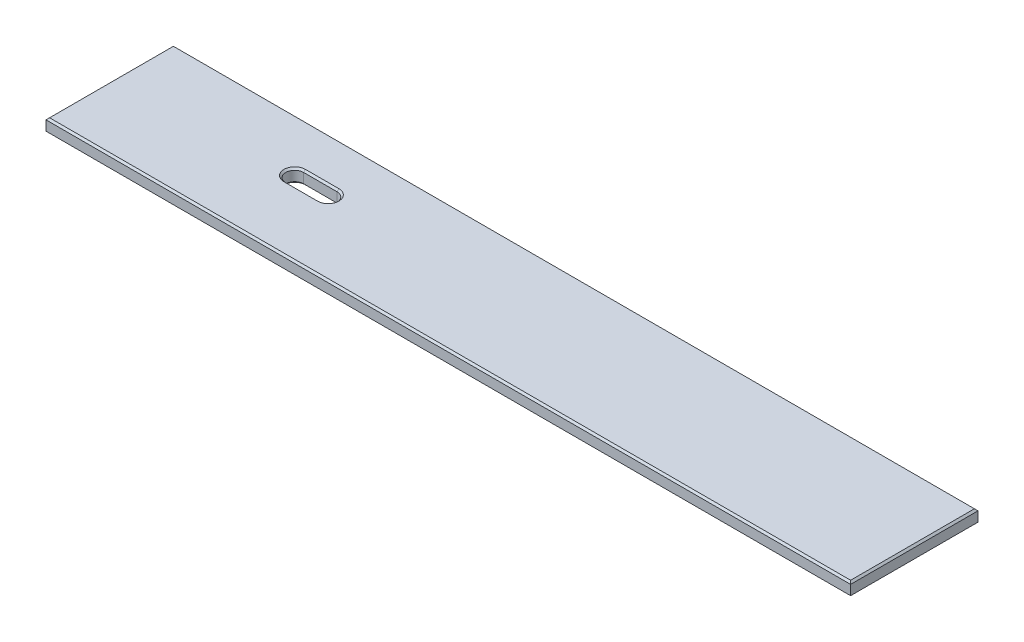
ISO-10303-21;
HEADER;
FILE_DESCRIPTION(('STEP AP214'),'2;1');
FILE_NAME('part.step','',(''),(''),'','','');
FILE_SCHEMA(('AUTOMOTIVE_DESIGN { 1 0 10303 214 1 1 1 1 }'));
ENDSEC;
DATA;
#1=APPLICATION_CONTEXT('core data for automotive mechanical design processes');
#2=APPLICATION_PROTOCOL_DEFINITION('international standard','automotive_design',2000,#1);
#3=PRODUCT_CONTEXT('',#1,'mechanical');
#4=PRODUCT('Part','Part','',(#3));
#5=PRODUCT_RELATED_PRODUCT_CATEGORY('part','',(#4));
#6=PRODUCT_DEFINITION_FORMATION('','',#4);
#7=PRODUCT_DEFINITION_CONTEXT('part definition',#1,'design');
#8=PRODUCT_DEFINITION('design','',#6,#7);
#9=PRODUCT_DEFINITION_SHAPE('','',#8);
#10=(LENGTH_UNIT() NAMED_UNIT(*) SI_UNIT(.MILLI.,.METRE.));
#11=(NAMED_UNIT(*) PLANE_ANGLE_UNIT() SI_UNIT($,.RADIAN.));
#12=(NAMED_UNIT(*) SI_UNIT($,.STERADIAN.) SOLID_ANGLE_UNIT());
#13=UNCERTAINTY_MEASURE_WITH_UNIT(LENGTH_MEASURE(1.E-05),#10,'distance_accuracy_value','');
#14=(GEOMETRIC_REPRESENTATION_CONTEXT(3) GLOBAL_UNCERTAINTY_ASSIGNED_CONTEXT((#13)) GLOBAL_UNIT_ASSIGNED_CONTEXT((#10,
#11,#12)) REPRESENTATION_CONTEXT('',''));
#15=CARTESIAN_POINT('',(0.,0.,0.));
#16=DIRECTION('',(0.,0.,1.));
#17=DIRECTION('',(1.,0.,0.));
#18=AXIS2_PLACEMENT_3D('',#15,#16,#17);
#19=CARTESIAN_POINT('',(0.,19.05,0.));
#20=DIRECTION('',(0.,-1.,0.));
#21=DIRECTION('',(0.,0.,-1.));
#22=AXIS2_PLACEMENT_3D('',#19,#20,#21);
#23=PLANE('',#22);
#24=CARTESIAN_POINT('',(247.7262,19.05,-105.55605));
#25=DIRECTION('',(0.,-1.,0.));
#26=DIRECTION('',(0.,0.,-1.));
#27=AXIS2_PLACEMENT_3D('',#24,#25,#26);
#28=CIRCLE('',#27,15.2400000000006);
#29=CARTESIAN_POINT('',(247.7262,19.05,-90.3160499999994));
#30=VERTEX_POINT('',#29);
#31=CARTESIAN_POINT('',(247.7262,19.05,-120.796050000001));
#32=VERTEX_POINT('',#31);
#33=EDGE_CURVE('E217',#30,#32,#28,.T.);
#34=ORIENTED_EDGE('',*,*,#33,.T.);
#35=DIRECTION('',(1.,0.,0.));
#36=VECTOR('',#35,1.);
#37=CARTESIAN_POINT('',(295.2877,19.05,-120.796050000001));
#38=LINE('',#37,#36);
#39=CARTESIAN_POINT('',(295.2877,19.05,-120.796050000001));
#40=VERTEX_POINT('',#39);
#41=EDGE_CURVE('E219',#32,#40,#38,.T.);
#42=ORIENTED_EDGE('',*,*,#41,.T.);
#43=CARTESIAN_POINT('',(295.2877,19.05,-105.55605));
#44=DIRECTION('',(0.,-1.,0.));
#45=DIRECTION('',(0.,0.,-1.));
#46=AXIS2_PLACEMENT_3D('',#43,#44,#45);
#47=CIRCLE('',#46,15.2400000000006);
#48=CARTESIAN_POINT('',(295.2877,19.05,-90.3160499999994));
#49=VERTEX_POINT('',#48);
#50=EDGE_CURVE('E188',#40,#49,#47,.T.);
#51=ORIENTED_EDGE('',*,*,#50,.T.);
#52=DIRECTION('',(-1.,0.,0.));
#53=VECTOR('',#52,1.);
#54=CARTESIAN_POINT('',(247.7262,19.05,-90.3160499999994));
#55=LINE('',#54,#53);
#56=EDGE_CURVE('E215',#49,#30,#55,.T.);
#57=ORIENTED_EDGE('',*,*,#56,.T.);
#58=EDGE_LOOP('',(#34,#42,#51,#57));
#59=FACE_BOUND('',#58,.T.);
#60=DIRECTION('',(0.,0.,-1.));
#61=VECTOR('',#60,1.);
#62=CARTESIAN_POINT('',(1140.46,19.05,0.));
#63=LINE('',#62,#61);
#64=CARTESIAN_POINT('',(1140.46,19.05,-2.5400000000001));
#65=VERTEX_POINT('',#64);
#66=CARTESIAN_POINT('',(1140.46,19.05,-178.435));
#67=VERTEX_POINT('',#66);
#68=EDGE_CURVE('E209',#65,#67,#63,.T.);
#69=ORIENTED_EDGE('',*,*,#68,.T.);
#70=DIRECTION('',(-1.,0.,0.));
#71=VECTOR('',#70,1.);
#72=CARTESIAN_POINT('',(0.,19.05,-178.435));
#73=LINE('',#72,#71);
#74=CARTESIAN_POINT('',(2.5400000000001,19.05,-178.435));
#75=VERTEX_POINT('',#74);
#76=EDGE_CURVE('E211',#67,#75,#73,.T.);
#77=ORIENTED_EDGE('',*,*,#76,.T.);
#78=DIRECTION('',(0.,0.,1.));
#79=VECTOR('',#78,1.);
#80=CARTESIAN_POINT('',(2.5400000000001,19.05,0.));
#81=LINE('',#80,#79);
#82=CARTESIAN_POINT('',(2.5400000000001,19.05,-2.5400000000001));
#83=VERTEX_POINT('',#82);
#84=EDGE_CURVE('E198',#75,#83,#81,.T.);
#85=ORIENTED_EDGE('',*,*,#84,.T.);
#86=DIRECTION('',(1.,0.,0.));
#87=VECTOR('',#86,1.);
#88=CARTESIAN_POINT('',(0.,19.05,-2.5400000000001));
#89=LINE('',#88,#87);
#90=EDGE_CURVE('E201',#83,#65,#89,.T.);
#91=ORIENTED_EDGE('',*,*,#90,.T.);
#92=EDGE_LOOP('',(#69,#77,#85,#91));
#93=FACE_BOUND('',#92,.T.);
#94=ADVANCED_FACE('F41',(#59,#93),#23,.F.);
#95=CARTESIAN_POINT('',(0.,0.,0.));
#96=DIRECTION('',(0.,-1.,0.));
#97=DIRECTION('',(0.,0.,-1.));
#98=AXIS2_PLACEMENT_3D('',#95,#96,#97);
#99=PLANE('',#98);
#100=DIRECTION('',(-1.,0.,0.));
#101=VECTOR('',#100,1.);
#102=CARTESIAN_POINT('',(0.,0.,-120.79605));
#103=LINE('',#102,#101);
#104=CARTESIAN_POINT('',(295.2877,0.,-120.79605));
#105=VERTEX_POINT('',#104);
#106=CARTESIAN_POINT('',(247.7262,0.,-120.79605));
#107=VERTEX_POINT('',#106);
#108=EDGE_CURVE('E261',#105,#107,#103,.T.);
#109=ORIENTED_EDGE('',*,*,#108,.T.);
#110=CARTESIAN_POINT('',(247.7262,0.,-105.55605));
#111=DIRECTION('',(0.,-1.,0.));
#112=DIRECTION('',(0.,0.,-1.));
#113=AXIS2_PLACEMENT_3D('',#110,#111,#112);
#114=CIRCLE('',#113,15.2400000000001);
#115=CARTESIAN_POINT('',(247.7262,0.,-90.3160499999999));
#116=VERTEX_POINT('',#115);
#117=EDGE_CURVE('E263',#107,#116,#114,.F.);
#118=ORIENTED_EDGE('',*,*,#117,.T.);
#119=DIRECTION('',(1.,0.,0.));
#120=VECTOR('',#119,1.);
#121=CARTESIAN_POINT('',(0.,0.,-90.3160499999999));
#122=LINE('',#121,#120);
#123=CARTESIAN_POINT('',(295.2877,0.,-90.3160499999999));
#124=VERTEX_POINT('',#123);
#125=EDGE_CURVE('E257',#116,#124,#122,.T.);
#126=ORIENTED_EDGE('',*,*,#125,.T.);
#127=CARTESIAN_POINT('',(295.2877,0.,-105.55605));
#128=DIRECTION('',(0.,-1.,0.));
#129=DIRECTION('',(0.,0.,-1.));
#130=AXIS2_PLACEMENT_3D('',#127,#128,#129);
#131=CIRCLE('',#130,15.2400000000001);
#132=EDGE_CURVE('E259',#124,#105,#131,.F.);
#133=ORIENTED_EDGE('',*,*,#132,.T.);
#134=EDGE_LOOP('',(#109,#118,#126,#133));
#135=FACE_BOUND('',#134,.T.);
#136=DIRECTION('',(0.,0.,1.));
#137=VECTOR('',#136,1.);
#138=CARTESIAN_POINT('',(1140.46,0.,0.));
#139=LINE('',#138,#137);
#140=CARTESIAN_POINT('',(1140.46,0.,-178.435));
#141=VERTEX_POINT('',#140);
#142=CARTESIAN_POINT('',(1140.46,0.,-2.53999999999999));
#143=VERTEX_POINT('',#142);
#144=EDGE_CURVE('E252',#141,#143,#139,.T.);
#145=ORIENTED_EDGE('',*,*,#144,.T.);
#146=DIRECTION('',(-1.,0.,0.));
#147=VECTOR('',#146,1.);
#148=CARTESIAN_POINT('',(0.,0.,-2.53999999999999));
#149=LINE('',#148,#147);
#150=CARTESIAN_POINT('',(2.53999999999999,0.,-2.53999999999999));
#151=VERTEX_POINT('',#150);
#152=EDGE_CURVE('E254',#143,#151,#149,.T.);
#153=ORIENTED_EDGE('',*,*,#152,.T.);
#154=DIRECTION('',(0.,0.,-1.));
#155=VECTOR('',#154,1.);
#156=CARTESIAN_POINT('',(2.53999999999999,0.,-180.975));
#157=LINE('',#156,#155);
#158=CARTESIAN_POINT('',(2.53999999999999,0.,-178.435));
#159=VERTEX_POINT('',#158);
#160=EDGE_CURVE('E232',#151,#159,#157,.T.);
#161=ORIENTED_EDGE('',*,*,#160,.T.);
#162=DIRECTION('',(1.,0.,0.));
#163=VECTOR('',#162,1.);
#164=CARTESIAN_POINT('',(1143.,0.,-178.435));
#165=LINE('',#164,#163);
#166=EDGE_CURVE('E250',#159,#141,#165,.T.);
#167=ORIENTED_EDGE('',*,*,#166,.T.);
#168=EDGE_LOOP('',(#145,#153,#161,#167));
#169=FACE_BOUND('',#168,.T.);
#170=ADVANCED_FACE('F306',(#135,#169),#99,.T.);
#171=CARTESIAN_POINT('',(0.,19.05,0.));
#172=DIRECTION('',(1.,0.,0.));
#173=DIRECTION('',(0.,0.,-1.));
#174=AXIS2_PLACEMENT_3D('',#171,#172,#173);
#175=PLANE('',#174);
#176=DIRECTION('',(0.,-1.,0.));
#177=VECTOR('',#176,1.);
#178=CARTESIAN_POINT('',(0.,19.05,-180.975));
#179=LINE('',#178,#177);
#180=CARTESIAN_POINT('',(0.,16.51,-180.975));
#181=VERTEX_POINT('',#180);
#182=CARTESIAN_POINT('',(0.,2.5400000000001,-180.975));
#183=VERTEX_POINT('',#182);
#184=EDGE_CURVE('E182',#181,#183,#179,.T.);
#185=ORIENTED_EDGE('',*,*,#184,.T.);
#186=DIRECTION('',(0.,0.,1.));
#187=VECTOR('',#186,1.);
#188=CARTESIAN_POINT('',(0.,2.5400000000001,0.));
#189=LINE('',#188,#187);
#190=CARTESIAN_POINT('',(0.,2.5400000000001,0.));
#191=VERTEX_POINT('',#190);
#192=EDGE_CURVE('E11',#183,#191,#189,.T.);
#193=ORIENTED_EDGE('',*,*,#192,.T.);
#194=DIRECTION('',(0.,-1.,0.));
#195=VECTOR('',#194,1.);
#196=CARTESIAN_POINT('',(0.,19.05,0.));
#197=LINE('',#196,#195);
#198=CARTESIAN_POINT('',(0.,16.51,0.));
#199=VERTEX_POINT('',#198);
#200=EDGE_CURVE('E199',#199,#191,#197,.T.);
#201=ORIENTED_EDGE('',*,*,#200,.F.);
#202=DIRECTION('',(0.,0.,-1.));
#203=VECTOR('',#202,1.);
#204=CARTESIAN_POINT('',(0.,16.51,0.));
#205=LINE('',#204,#203);
#206=EDGE_CURVE('E230',#199,#181,#205,.T.);
#207=ORIENTED_EDGE('',*,*,#206,.T.);
#208=EDGE_LOOP('',(#185,#193,#201,#207));
#209=FACE_BOUND('',#208,.T.);
#210=ADVANCED_FACE('F379',(#209),#175,.F.);
#211=CARTESIAN_POINT('',(0.,19.05,0.));
#212=DIRECTION('',(0.,0.,-1.));
#213=DIRECTION('',(-1.,0.,0.));
#214=AXIS2_PLACEMENT_3D('',#211,#212,#213);
#215=PLANE('',#214);
#216=ORIENTED_EDGE('',*,*,#200,.T.);
#217=DIRECTION('',(1.,0.,0.));
#218=VECTOR('',#217,1.);
#219=CARTESIAN_POINT('',(1143.,2.5400000000001,0.));
#220=LINE('',#219,#218);
#221=CARTESIAN_POINT('',(1143.,2.5400000000001,0.));
#222=VERTEX_POINT('',#221);
#223=EDGE_CURVE('E274',#191,#222,#220,.T.);
#224=ORIENTED_EDGE('',*,*,#223,.T.);
#225=DIRECTION('',(0.,-1.,0.));
#226=VECTOR('',#225,1.);
#227=CARTESIAN_POINT('',(1143.,19.05,0.));
#228=LINE('',#227,#226);
#229=CARTESIAN_POINT('',(1143.,16.51,0.));
#230=VERTEX_POINT('',#229);
#231=EDGE_CURVE('E204',#230,#222,#228,.T.);
#232=ORIENTED_EDGE('',*,*,#231,.F.);
#233=DIRECTION('',(-1.,0.,0.));
#234=VECTOR('',#233,1.);
#235=CARTESIAN_POINT('',(0.,16.51,0.));
#236=LINE('',#235,#234);
#237=EDGE_CURVE('E228',#230,#199,#236,.T.);
#238=ORIENTED_EDGE('',*,*,#237,.T.);
#239=EDGE_LOOP('',(#216,#224,#232,#238));
#240=FACE_BOUND('',#239,.T.);
#241=ADVANCED_FACE('F315',(#240),#215,.F.);
#242=CARTESIAN_POINT('',(1143.,19.05,0.));
#243=DIRECTION('',(-1.,0.,0.));
#244=DIRECTION('',(0.,0.,1.));
#245=AXIS2_PLACEMENT_3D('',#242,#243,#244);
#246=PLANE('',#245);
#247=ORIENTED_EDGE('',*,*,#231,.T.);
#248=DIRECTION('',(0.,0.,-1.));
#249=VECTOR('',#248,1.);
#250=CARTESIAN_POINT('',(1143.,2.5400000000001,-180.975));
#251=LINE('',#250,#249);
#252=CARTESIAN_POINT('',(1143.,2.5400000000001,-180.975));
#253=VERTEX_POINT('',#252);
#254=EDGE_CURVE('E66',#222,#253,#251,.T.);
#255=ORIENTED_EDGE('',*,*,#254,.T.);
#256=DIRECTION('',(0.,-1.,0.));
#257=VECTOR('',#256,1.);
#258=CARTESIAN_POINT('',(1143.,19.05,-180.975));
#259=LINE('',#258,#257);
#260=CARTESIAN_POINT('',(1143.,16.51,-180.975));
#261=VERTEX_POINT('',#260);
#262=EDGE_CURVE('E320',#261,#253,#259,.T.);
#263=ORIENTED_EDGE('',*,*,#262,.F.);
#264=DIRECTION('',(0.,0.,1.));
#265=VECTOR('',#264,1.);
#266=CARTESIAN_POINT('',(1143.,16.51,0.));
#267=LINE('',#266,#265);
#268=EDGE_CURVE('E226',#261,#230,#267,.T.);
#269=ORIENTED_EDGE('',*,*,#268,.T.);
#270=EDGE_LOOP('',(#247,#255,#263,#269));
#271=FACE_BOUND('',#270,.T.);
#272=ADVANCED_FACE('F318',(#271),#246,.F.);
#273=CARTESIAN_POINT('',(0.,19.05,-180.975));
#274=DIRECTION('',(0.,0.,1.));
#275=DIRECTION('',(1.,0.,0.));
#276=AXIS2_PLACEMENT_3D('',#273,#274,#275);
#277=PLANE('',#276);
#278=ORIENTED_EDGE('',*,*,#262,.T.);
#279=DIRECTION('',(-1.,0.,0.));
#280=VECTOR('',#279,1.);
#281=CARTESIAN_POINT('',(0.,2.5400000000001,-180.975));
#282=LINE('',#281,#280);
#283=EDGE_CURVE('E51',#253,#183,#282,.T.);
#284=ORIENTED_EDGE('',*,*,#283,.T.);
#285=ORIENTED_EDGE('',*,*,#184,.F.);
#286=DIRECTION('',(1.,0.,0.));
#287=VECTOR('',#286,1.);
#288=CARTESIAN_POINT('',(0.,16.51,-180.975));
#289=LINE('',#288,#287);
#290=EDGE_CURVE('E170',#181,#261,#289,.T.);
#291=ORIENTED_EDGE('',*,*,#290,.T.);
#292=EDGE_LOOP('',(#278,#284,#285,#291));
#293=FACE_BOUND('',#292,.T.);
#294=ADVANCED_FACE('F380',(#293),#277,.F.);
#295=CARTESIAN_POINT('',(295.2877,19.05,-105.55605));
#296=DIRECTION('',(0.,-1.,0.));
#297=DIRECTION('',(0.,0.,-1.));
#298=AXIS2_PLACEMENT_3D('',#295,#296,#297);
#299=CYLINDRICAL_SURFACE('',#298,12.7);
#300=DIRECTION('',(0.,-1.,0.));
#301=VECTOR('',#300,1.);
#302=CARTESIAN_POINT('',(295.2877,19.05,-118.25605));
#303=LINE('',#302,#301);
#304=CARTESIAN_POINT('',(295.2877,16.5099999999995,-118.25605));
#305=VERTEX_POINT('',#304);
#306=CARTESIAN_POINT('',(295.2877,2.5400000000001,-118.25605));
#307=VERTEX_POINT('',#306);
#308=EDGE_CURVE('E162',#305,#307,#303,.T.);
#309=ORIENTED_EDGE('',*,*,#308,.T.);
#310=CARTESIAN_POINT('',(295.2877,2.5400000000001,-105.55605));
#311=DIRECTION('',(0.,-1.,0.));
#312=DIRECTION('',(0.,0.,-1.));
#313=AXIS2_PLACEMENT_3D('',#310,#311,#312);
#314=CIRCLE('',#313,12.7);
#315=CARTESIAN_POINT('',(295.2877,2.5400000000001,-92.85605));
#316=VERTEX_POINT('',#315);
#317=EDGE_CURVE('E270',#307,#316,#314,.T.);
#318=ORIENTED_EDGE('',*,*,#317,.T.);
#319=DIRECTION('',(0.,-1.,0.));
#320=VECTOR('',#319,1.);
#321=CARTESIAN_POINT('',(295.2877,19.05,-92.85605));
#322=LINE('',#321,#320);
#323=CARTESIAN_POINT('',(295.2877,16.5099999999995,-92.85605));
#324=VERTEX_POINT('',#323);
#325=EDGE_CURVE('E165',#324,#316,#322,.T.);
#326=ORIENTED_EDGE('',*,*,#325,.F.);
#327=CARTESIAN_POINT('',(295.2877,16.5099999999995,-105.55605));
#328=DIRECTION('',(0.,-1.,0.));
#329=DIRECTION('',(0.,0.,-1.));
#330=AXIS2_PLACEMENT_3D('',#327,#328,#329);
#331=CIRCLE('',#330,12.7);
#332=EDGE_CURVE('E159',#324,#305,#331,.F.);
#333=ORIENTED_EDGE('',*,*,#332,.T.);
#334=EDGE_LOOP('',(#309,#318,#326,#333));
#335=FACE_BOUND('',#334,.T.);
#336=ADVANCED_FACE('F161',(#335),#299,.F.);
#337=CARTESIAN_POINT('',(247.7262,19.05,-118.25605));
#338=DIRECTION('',(0.,0.,1.));
#339=DIRECTION('',(1.,0.,0.));
#340=AXIS2_PLACEMENT_3D('',#337,#338,#339);
#341=PLANE('',#340);
#342=DIRECTION('',(0.,-1.,0.));
#343=VECTOR('',#342,1.);
#344=CARTESIAN_POINT('',(247.7262,19.05,-118.25605));
#345=LINE('',#344,#343);
#346=CARTESIAN_POINT('',(247.7262,16.5099999999995,-118.25605));
#347=VERTEX_POINT('',#346);
#348=CARTESIAN_POINT('',(247.7262,2.5400000000001,-118.25605));
#349=VERTEX_POINT('',#348);
#350=EDGE_CURVE('E183',#347,#349,#345,.T.);
#351=ORIENTED_EDGE('',*,*,#350,.T.);
#352=DIRECTION('',(1.,0.,0.));
#353=VECTOR('',#352,1.);
#354=CARTESIAN_POINT('',(247.7262,2.5400000000001,-118.25605));
#355=LINE('',#354,#353);
#356=EDGE_CURVE('E181',#349,#307,#355,.T.);
#357=ORIENTED_EDGE('',*,*,#356,.T.);
#358=ORIENTED_EDGE('',*,*,#308,.F.);
#359=DIRECTION('',(-1.,0.,0.));
#360=VECTOR('',#359,1.);
#361=CARTESIAN_POINT('',(247.7262,16.5099999999995,-118.25605));
#362=LINE('',#361,#360);
#363=EDGE_CURVE('E178',#305,#347,#362,.T.);
#364=ORIENTED_EDGE('',*,*,#363,.T.);
#365=EDGE_LOOP('',(#351,#357,#358,#364));
#366=FACE_BOUND('',#365,.T.);
#367=ADVANCED_FACE('F176',(#366),#341,.T.);
#368=CARTESIAN_POINT('',(247.7262,19.05,-105.55605));
#369=DIRECTION('',(0.,-1.,0.));
#370=DIRECTION('',(0.,0.,-1.));
#371=AXIS2_PLACEMENT_3D('',#368,#369,#370);
#372=CYLINDRICAL_SURFACE('',#371,12.7);
#373=DIRECTION('',(0.,-1.,0.));
#374=VECTOR('',#373,1.);
#375=CARTESIAN_POINT('',(247.7262,19.05,-92.85605));
#376=LINE('',#375,#374);
#377=CARTESIAN_POINT('',(247.7262,16.5099999999995,-92.85605));
#378=VERTEX_POINT('',#377);
#379=CARTESIAN_POINT('',(247.7262,2.5400000000001,-92.85605));
#380=VERTEX_POINT('',#379);
#381=EDGE_CURVE('E325',#378,#380,#376,.T.);
#382=ORIENTED_EDGE('',*,*,#381,.T.);
#383=CARTESIAN_POINT('',(247.7262,2.5400000000001,-105.55605));
#384=DIRECTION('',(0.,-1.,0.));
#385=DIRECTION('',(0.,0.,-1.));
#386=AXIS2_PLACEMENT_3D('',#383,#384,#385);
#387=CIRCLE('',#386,12.7);
#388=EDGE_CURVE('E266',#380,#349,#387,.T.);
#389=ORIENTED_EDGE('',*,*,#388,.T.);
#390=ORIENTED_EDGE('',*,*,#350,.F.);
#391=CARTESIAN_POINT('',(247.7262,16.5099999999995,-105.55605));
#392=DIRECTION('',(0.,-1.,0.));
#393=DIRECTION('',(0.,0.,-1.));
#394=AXIS2_PLACEMENT_3D('',#391,#392,#393);
#395=CIRCLE('',#394,12.7);
#396=EDGE_CURVE('E221',#347,#378,#395,.F.);
#397=ORIENTED_EDGE('',*,*,#396,.T.);
#398=EDGE_LOOP('',(#382,#389,#390,#397));
#399=FACE_BOUND('',#398,.T.);
#400=ADVANCED_FACE('F348',(#399),#372,.F.);
#401=CARTESIAN_POINT('',(247.7262,19.05,-92.85605));
#402=DIRECTION('',(0.,0.,-1.));
#403=DIRECTION('',(-1.,0.,0.));
#404=AXIS2_PLACEMENT_3D('',#401,#402,#403);
#405=PLANE('',#404);
#406=ORIENTED_EDGE('',*,*,#325,.T.);
#407=DIRECTION('',(-1.,0.,0.));
#408=VECTOR('',#407,1.);
#409=CARTESIAN_POINT('',(247.7262,2.5400000000001,-92.85605));
#410=LINE('',#409,#408);
#411=EDGE_CURVE('E272',#316,#380,#410,.T.);
#412=ORIENTED_EDGE('',*,*,#411,.T.);
#413=ORIENTED_EDGE('',*,*,#381,.F.);
#414=DIRECTION('',(1.,0.,0.));
#415=VECTOR('',#414,1.);
#416=CARTESIAN_POINT('',(295.2877,16.5099999999995,-92.85605));
#417=LINE('',#416,#415);
#418=EDGE_CURVE('E171',#378,#324,#417,.T.);
#419=ORIENTED_EDGE('',*,*,#418,.T.);
#420=EDGE_LOOP('',(#406,#412,#413,#419));
#421=FACE_BOUND('',#420,.T.);
#422=ADVANCED_FACE('F330',(#421),#405,.T.);
#423=CARTESIAN_POINT('',(247.7262,16.5099999999995,-92.85605));
#424=DIRECTION('',(0.,0.707106781186557,-0.707106781186538));
#425=DIRECTION('',(-1.,0.,0.));
#426=AXIS2_PLACEMENT_3D('',#423,#424,#425);
#427=PLANE('',#426);
#428=DIRECTION('',(0.,-0.707106781186538,-0.707106781186557));
#429=VECTOR('',#428,1.);
#430=CARTESIAN_POINT('',(247.7262,19.05,-90.3160499999994));
#431=LINE('',#430,#429);
#432=EDGE_CURVE('E192',#30,#378,#431,.T.);
#433=ORIENTED_EDGE('',*,*,#432,.F.);
#434=ORIENTED_EDGE('',*,*,#56,.F.);
#435=DIRECTION('',(0.,0.707106781186538,0.707106781186557));
#436=VECTOR('',#435,1.);
#437=CARTESIAN_POINT('',(295.2877,16.5099999999995,-92.85605));
#438=LINE('',#437,#436);
#439=EDGE_CURVE('E237',#324,#49,#438,.T.);
#440=ORIENTED_EDGE('',*,*,#439,.F.);
#441=ORIENTED_EDGE('',*,*,#418,.F.);
#442=EDGE_LOOP('',(#433,#434,#440,#441));
#443=FACE_BOUND('',#442,.T.);
#444=ADVANCED_FACE('F351',(#443),#427,.T.);
#445=CARTESIAN_POINT('',(295.2877,16.5099999999995,-105.55605));
#446=DIRECTION('',(0.,1.,0.));
#447=DIRECTION('',(0.,0.,1.));
#448=AXIS2_PLACEMENT_3D('',#445,#446,#447);
#449=CONICAL_SURFACE('',#448,12.7,0.785398163397461);
#450=ORIENTED_EDGE('',*,*,#439,.T.);
#451=ORIENTED_EDGE('',*,*,#50,.F.);
#452=DIRECTION('',(0.,0.707106781186538,-0.707106781186557));
#453=VECTOR('',#452,1.);
#454=CARTESIAN_POINT('',(295.2877,16.5099999999995,-118.25605));
#455=LINE('',#454,#453);
#456=EDGE_CURVE('E186',#305,#40,#455,.T.);
#457=ORIENTED_EDGE('',*,*,#456,.F.);
#458=ORIENTED_EDGE('',*,*,#332,.F.);
#459=EDGE_LOOP('',(#450,#451,#457,#458));
#460=FACE_BOUND('',#459,.T.);
#461=ADVANCED_FACE('F187',(#460),#449,.F.);
#462=CARTESIAN_POINT('',(247.7262,16.5099999999995,-105.55605));
#463=DIRECTION('',(0.,1.,0.));
#464=DIRECTION('',(0.,0.,1.));
#465=AXIS2_PLACEMENT_3D('',#462,#463,#464);
#466=CONICAL_SURFACE('',#465,12.7,0.785398163397461);
#467=ORIENTED_EDGE('',*,*,#432,.T.);
#468=ORIENTED_EDGE('',*,*,#396,.F.);
#469=DIRECTION('',(0.,-0.707106781186538,0.707106781186557));
#470=VECTOR('',#469,1.);
#471=CARTESIAN_POINT('',(247.7262,19.05,-120.796050000001));
#472=LINE('',#471,#470);
#473=EDGE_CURVE('E193',#32,#347,#472,.T.);
#474=ORIENTED_EDGE('',*,*,#473,.F.);
#475=ORIENTED_EDGE('',*,*,#33,.F.);
#476=EDGE_LOOP('',(#467,#468,#474,#475));
#477=FACE_BOUND('',#476,.T.);
#478=ADVANCED_FACE('F355',(#477),#466,.F.);
#479=CARTESIAN_POINT('',(247.7262,16.5099999999995,-118.25605));
#480=DIRECTION('',(0.,0.707106781186557,0.707106781186538));
#481=DIRECTION('',(1.,0.,0.));
#482=AXIS2_PLACEMENT_3D('',#479,#480,#481);
#483=PLANE('',#482);
#484=ORIENTED_EDGE('',*,*,#456,.T.);
#485=ORIENTED_EDGE('',*,*,#41,.F.);
#486=ORIENTED_EDGE('',*,*,#473,.T.);
#487=ORIENTED_EDGE('',*,*,#363,.F.);
#488=EDGE_LOOP('',(#484,#485,#486,#487));
#489=FACE_BOUND('',#488,.T.);
#490=ADVANCED_FACE('F195',(#489),#483,.T.);
#491=CARTESIAN_POINT('',(0.,19.05,-2.5400000000001));
#492=DIRECTION('',(0.,-0.707106781186563,-0.707106781186532));
#493=DIRECTION('',(1.,0.,0.));
#494=AXIS2_PLACEMENT_3D('',#491,#492,#493);
#495=PLANE('',#494);
#496=DIRECTION('',(0.577350269189634,0.577350269189609,-0.577350269189634));
#497=VECTOR('',#496,1.);
#498=CARTESIAN_POINT('',(1.69333333333337,18.2033333333333,-1.69333333333337));
#499=LINE('',#498,#497);
#500=EDGE_CURVE('E244',#199,#83,#499,.T.);
#501=ORIENTED_EDGE('',*,*,#500,.F.);
#502=ORIENTED_EDGE('',*,*,#237,.F.);
#503=DIRECTION('',(-0.577350269189617,0.577350269189618,-0.577350269189642));
#504=VECTOR('',#503,1.);
#505=CARTESIAN_POINT('',(760.306666666678,399.203333333322,-382.693333333339));
#506=LINE('',#505,#504);
#507=EDGE_CURVE('E233',#65,#230,#506,.F.);
#508=ORIENTED_EDGE('',*,*,#507,.F.);
#509=ORIENTED_EDGE('',*,*,#90,.F.);
#510=EDGE_LOOP('',(#501,#502,#508,#509));
#511=FACE_BOUND('',#510,.T.);
#512=ADVANCED_FACE('F377',(#511),#495,.F.);
#513=CARTESIAN_POINT('',(1140.46,19.05,0.));
#514=DIRECTION('',(-0.707106781186548,-0.707106781186548,0.));
#515=DIRECTION('',(0.,0.,-1.));
#516=AXIS2_PLACEMENT_3D('',#513,#514,#515);
#517=PLANE('',#516);
#518=ORIENTED_EDGE('',*,*,#507,.T.);
#519=ORIENTED_EDGE('',*,*,#268,.F.);
#520=DIRECTION('',(-0.577350269189617,0.577350269189617,0.577350269189642));
#521=VECTOR('',#520,1.);
#522=CARTESIAN_POINT('',(1080.98166666667,78.5283333333342,-118.956666666663));
#523=LINE('',#522,#521);
#524=EDGE_CURVE('E241',#67,#261,#523,.F.);
#525=ORIENTED_EDGE('',*,*,#524,.F.);
#526=ORIENTED_EDGE('',*,*,#68,.F.);
#527=EDGE_LOOP('',(#518,#519,#525,#526));
#528=FACE_BOUND('',#527,.T.);
#529=ADVANCED_FACE('F366',(#528),#517,.F.);
#530=CARTESIAN_POINT('',(2.5400000000001,19.05,0.));
#531=DIRECTION('',(0.707106781186532,-0.707106781186563,0.));
#532=DIRECTION('',(0.,0.,1.));
#533=AXIS2_PLACEMENT_3D('',#530,#531,#532);
#534=PLANE('',#533);
#535=ORIENTED_EDGE('',*,*,#500,.T.);
#536=ORIENTED_EDGE('',*,*,#84,.F.);
#537=DIRECTION('',(-0.577350269189634,-0.577350269189609,-0.577350269189634));
#538=VECTOR('',#537,1.);
#539=CARTESIAN_POINT('',(62.0183333333351,78.5283333333325,-118.956666666665));
#540=LINE('',#539,#538);
#541=EDGE_CURVE('E239',#181,#75,#540,.F.);
#542=ORIENTED_EDGE('',*,*,#541,.F.);
#543=ORIENTED_EDGE('',*,*,#206,.F.);
#544=EDGE_LOOP('',(#535,#536,#542,#543));
#545=FACE_BOUND('',#544,.T.);
#546=ADVANCED_FACE('F374',(#545),#534,.F.);
#547=CARTESIAN_POINT('',(0.,19.05,-178.435));
#548=DIRECTION('',(0.,-0.707106781186563,0.707106781186532));
#549=DIRECTION('',(-1.,0.,0.));
#550=AXIS2_PLACEMENT_3D('',#547,#548,#549);
#551=PLANE('',#550);
#552=ORIENTED_EDGE('',*,*,#524,.T.);
#553=ORIENTED_EDGE('',*,*,#290,.F.);
#554=ORIENTED_EDGE('',*,*,#541,.T.);
#555=ORIENTED_EDGE('',*,*,#76,.F.);
#556=EDGE_LOOP('',(#552,#553,#554,#555));
#557=FACE_BOUND('',#556,.T.);
#558=ADVANCED_FACE('F369',(#557),#551,.F.);
#559=CARTESIAN_POINT('',(295.2877,0.,-105.55605));
#560=DIRECTION('',(0.,-1.,0.));
#561=DIRECTION('',(0.,0.,-1.));
#562=AXIS2_PLACEMENT_3D('',#559,#560,#561);
#563=CONICAL_SURFACE('',#562,15.2400000000001,0.785398163397448);
#564=DIRECTION('',(0.,-0.707106781186548,0.707106781186548));
#565=VECTOR('',#564,1.);
#566=CARTESIAN_POINT('',(295.2877,2.5400000000001,-92.85605));
#567=LINE('',#566,#565);
#568=EDGE_CURVE('E283',#316,#124,#567,.T.);
#569=ORIENTED_EDGE('',*,*,#568,.F.);
#570=ORIENTED_EDGE('',*,*,#317,.F.);
#571=DIRECTION('',(0.,0.707106781186548,0.707106781186548));
#572=VECTOR('',#571,1.);
#573=CARTESIAN_POINT('',(295.2877,0.,-120.79605));
#574=LINE('',#573,#572);
#575=EDGE_CURVE('E242',#105,#307,#574,.T.);
#576=ORIENTED_EDGE('',*,*,#575,.F.);
#577=ORIENTED_EDGE('',*,*,#132,.F.);
#578=EDGE_LOOP('',(#569,#570,#576,#577));
#579=FACE_BOUND('',#578,.T.);
#580=ADVANCED_FACE('F336',(#579),#563,.F.);
#581=CARTESIAN_POINT('',(0.,0.,-120.79605));
#582=DIRECTION('',(0.,0.707106781186548,-0.707106781186548));
#583=DIRECTION('',(-1.,0.,0.));
#584=AXIS2_PLACEMENT_3D('',#581,#582,#583);
#585=PLANE('',#584);
#586=ORIENTED_EDGE('',*,*,#575,.T.);
#587=ORIENTED_EDGE('',*,*,#356,.F.);
#588=DIRECTION('',(0.,0.707106781186548,0.707106781186548));
#589=VECTOR('',#588,1.);
#590=CARTESIAN_POINT('',(247.7262,0.,-120.79605));
#591=LINE('',#590,#589);
#592=EDGE_CURVE('E281',#107,#349,#591,.T.);
#593=ORIENTED_EDGE('',*,*,#592,.F.);
#594=ORIENTED_EDGE('',*,*,#108,.F.);
#595=EDGE_LOOP('',(#586,#587,#593,#594));
#596=FACE_BOUND('',#595,.T.);
#597=ADVANCED_FACE('F447',(#596),#585,.F.);
#598=CARTESIAN_POINT('',(0.,0.,-90.3160499999999));
#599=DIRECTION('',(0.,0.707106781186548,0.707106781186548));
#600=DIRECTION('',(1.,0.,0.));
#601=AXIS2_PLACEMENT_3D('',#598,#599,#600);
#602=PLANE('',#601);
#603=ORIENTED_EDGE('',*,*,#568,.T.);
#604=ORIENTED_EDGE('',*,*,#125,.F.);
#605=DIRECTION('',(0.,-0.707106781186548,0.707106781186548));
#606=VECTOR('',#605,1.);
#607=CARTESIAN_POINT('',(247.7262,2.5400000000001,-92.85605));
#608=LINE('',#607,#606);
#609=EDGE_CURVE('E279',#380,#116,#608,.T.);
#610=ORIENTED_EDGE('',*,*,#609,.F.);
#611=ORIENTED_EDGE('',*,*,#411,.F.);
#612=EDGE_LOOP('',(#603,#604,#610,#611));
#613=FACE_BOUND('',#612,.T.);
#614=ADVANCED_FACE('F341',(#613),#602,.F.);
#615=CARTESIAN_POINT('',(247.7262,0.,-105.55605));
#616=DIRECTION('',(0.,-1.,0.));
#617=DIRECTION('',(0.,0.,-1.));
#618=AXIS2_PLACEMENT_3D('',#615,#616,#617);
#619=CONICAL_SURFACE('',#618,15.2400000000001,0.785398163397448);
#620=ORIENTED_EDGE('',*,*,#592,.T.);
#621=ORIENTED_EDGE('',*,*,#388,.F.);
#622=ORIENTED_EDGE('',*,*,#609,.T.);
#623=ORIENTED_EDGE('',*,*,#117,.F.);
#624=EDGE_LOOP('',(#620,#621,#622,#623));
#625=FACE_BOUND('',#624,.T.);
#626=ADVANCED_FACE('F345',(#625),#619,.F.);
#627=CARTESIAN_POINT('',(0.,2.5400000000001,-180.975));
#628=DIRECTION('',(0.,-0.707106781186532,-0.707106781186563));
#629=DIRECTION('',(1.,0.,0.));
#630=AXIS2_PLACEMENT_3D('',#627,#628,#629);
#631=PLANE('',#630);
#632=DIRECTION('',(-0.577350269189617,-0.577350269189642,0.577350269189617));
#633=VECTOR('',#632,1.);
#634=CARTESIAN_POINT('',(762.000000000011,-378.460000000005,200.024999999989));
#635=LINE('',#634,#633);
#636=EDGE_CURVE('E291',#141,#253,#635,.F.);
#637=ORIENTED_EDGE('',*,*,#636,.F.);
#638=ORIENTED_EDGE('',*,*,#166,.F.);
#639=DIRECTION('',(0.577350269189617,-0.577350269189643,0.577350269189617));
#640=VECTOR('',#639,1.);
#641=CARTESIAN_POINT('',(60.3249999999982,-57.7850000000008,-120.650000000002));
#642=LINE('',#641,#640);
#643=EDGE_CURVE('E46',#183,#159,#642,.T.);
#644=ORIENTED_EDGE('',*,*,#643,.F.);
#645=ORIENTED_EDGE('',*,*,#283,.F.);
#646=EDGE_LOOP('',(#637,#638,#644,#645));
#647=FACE_BOUND('',#646,.T.);
#648=ADVANCED_FACE('F44',(#647),#631,.T.);
#649=CARTESIAN_POINT('',(0.,2.5400000000001,0.));
#650=DIRECTION('',(-0.707106781186563,-0.707106781186532,0.));
#651=DIRECTION('',(0.,0.,-1.));
#652=AXIS2_PLACEMENT_3D('',#649,#650,#651);
#653=PLANE('',#652);
#654=ORIENTED_EDGE('',*,*,#643,.T.);
#655=ORIENTED_EDGE('',*,*,#160,.F.);
#656=DIRECTION('',(-0.577350269189617,0.577350269189643,0.577350269189617));
#657=VECTOR('',#656,1.);
#658=CARTESIAN_POINT('',(0.,2.5400000000001,0.));
#659=LINE('',#658,#657);
#660=EDGE_CURVE('E290',#191,#151,#659,.F.);
#661=ORIENTED_EDGE('',*,*,#660,.F.);
#662=ORIENTED_EDGE('',*,*,#192,.F.);
#663=EDGE_LOOP('',(#654,#655,#661,#662));
#664=FACE_BOUND('',#663,.T.);
#665=ADVANCED_FACE('F301',(#664),#653,.T.);
#666=CARTESIAN_POINT('',(1143.,2.5400000000001,0.));
#667=DIRECTION('',(0.707106781186563,-0.707106781186532,0.));
#668=DIRECTION('',(0.,0.,1.));
#669=AXIS2_PLACEMENT_3D('',#666,#667,#668);
#670=PLANE('',#669);
#671=ORIENTED_EDGE('',*,*,#636,.T.);
#672=ORIENTED_EDGE('',*,*,#254,.F.);
#673=DIRECTION('',(-0.577350269189617,-0.577350269189643,-0.577350269189617));
#674=VECTOR('',#673,1.);
#675=CARTESIAN_POINT('',(1143.,2.5400000000001,0.));
#676=LINE('',#675,#674);
#677=EDGE_CURVE('E288',#143,#222,#676,.F.);
#678=ORIENTED_EDGE('',*,*,#677,.F.);
#679=ORIENTED_EDGE('',*,*,#144,.F.);
#680=EDGE_LOOP('',(#671,#672,#678,#679));
#681=FACE_BOUND('',#680,.T.);
#682=ADVANCED_FACE('F312',(#681),#670,.T.);
#683=CARTESIAN_POINT('',(0.,2.5400000000001,0.));
#684=DIRECTION('',(0.,-0.707106781186532,0.707106781186563));
#685=DIRECTION('',(-1.,0.,0.));
#686=AXIS2_PLACEMENT_3D('',#683,#684,#685);
#687=PLANE('',#686);
#688=ORIENTED_EDGE('',*,*,#660,.T.);
#689=ORIENTED_EDGE('',*,*,#152,.F.);
#690=ORIENTED_EDGE('',*,*,#677,.T.);
#691=ORIENTED_EDGE('',*,*,#223,.F.);
#692=EDGE_LOOP('',(#688,#689,#690,#691));
#693=FACE_BOUND('',#692,.T.);
#694=ADVANCED_FACE('F310',(#693),#687,.T.);
#695=CLOSED_SHELL('',(#94,#170,#210,#241,#272,#294,#336,#367,#400,#422,#444,#461,#478,#490,#512,
#529,#546,#558,#580,#597,#614,#626,#648,#665,#682,#694));
#696=MANIFOLD_SOLID_BREP('B2',#695);
#697=ADVANCED_BREP_SHAPE_REPRESENTATION('',(#18,#696),#14);
#698=SHAPE_DEFINITION_REPRESENTATION(#9,#697);
ENDSEC;
END-ISO-10303-21;
